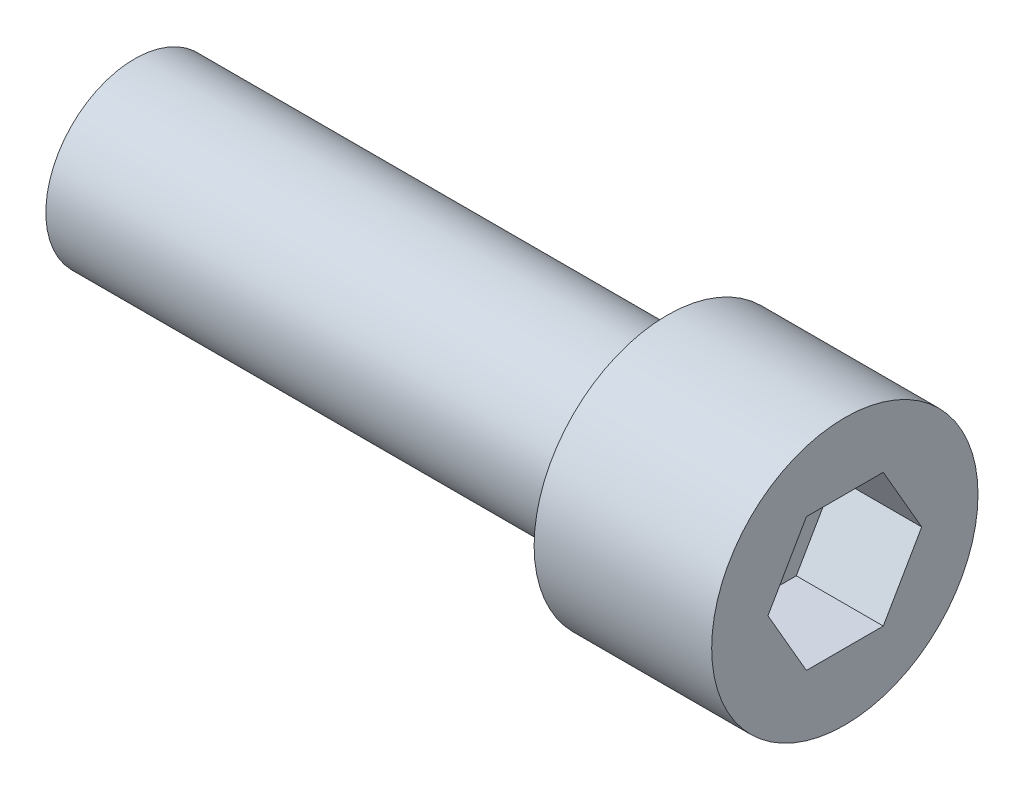
ISO-10303-21;
HEADER;
FILE_DESCRIPTION(('STEP AP214'),'2;1');
FILE_NAME('part.step','',(''),(''),'','','');
FILE_SCHEMA(('AUTOMOTIVE_DESIGN { 1 0 10303 214 1 1 1 1 }'));
ENDSEC;
DATA;
#1=APPLICATION_CONTEXT('core data for automotive mechanical design processes');
#2=APPLICATION_PROTOCOL_DEFINITION('international standard','automotive_design',2000,#1);
#3=PRODUCT_CONTEXT('',#1,'mechanical');
#4=PRODUCT('Part','Part','',(#3));
#5=PRODUCT_RELATED_PRODUCT_CATEGORY('part','',(#4));
#6=PRODUCT_DEFINITION_FORMATION('','',#4);
#7=PRODUCT_DEFINITION_CONTEXT('part definition',#1,'design');
#8=PRODUCT_DEFINITION('design','',#6,#7);
#9=PRODUCT_DEFINITION_SHAPE('','',#8);
#10=(LENGTH_UNIT() NAMED_UNIT(*) SI_UNIT(.MILLI.,.METRE.));
#11=(NAMED_UNIT(*) PLANE_ANGLE_UNIT() SI_UNIT($,.RADIAN.));
#12=(NAMED_UNIT(*) SI_UNIT($,.STERADIAN.) SOLID_ANGLE_UNIT());
#13=UNCERTAINTY_MEASURE_WITH_UNIT(LENGTH_MEASURE(1.E-05),#10,'distance_accuracy_value','');
#14=(GEOMETRIC_REPRESENTATION_CONTEXT(3) GLOBAL_UNCERTAINTY_ASSIGNED_CONTEXT((#13)) GLOBAL_UNIT_ASSIGNED_CONTEXT((#10,
#11,#12)) REPRESENTATION_CONTEXT('',''));
#15=CARTESIAN_POINT('',(0.,0.,0.));
#16=DIRECTION('',(0.,0.,1.));
#17=DIRECTION('',(1.,0.,0.));
#18=AXIS2_PLACEMENT_3D('',#15,#16,#17);
#19=CARTESIAN_POINT('',(-38.1,0.,0.));
#20=DIRECTION('',(1.,0.,0.));
#21=DIRECTION('',(0.,0.,-1.));
#22=AXIS2_PLACEMENT_3D('',#19,#20,#21);
#23=CYLINDRICAL_SURFACE('',#22,6.35);
#24=CARTESIAN_POINT('',(-38.1,0.,0.));
#25=DIRECTION('',(1.,0.,0.));
#26=DIRECTION('',(0.,0.,-1.));
#27=AXIS2_PLACEMENT_3D('',#24,#25,#26);
#28=CIRCLE('',#27,6.35);
#29=CARTESIAN_POINT('',(-38.1,0.,-6.35));
#30=VERTEX_POINT('',#29);
#31=EDGE_CURVE('E11',#30,#30,#28,.T.);
#32=ORIENTED_EDGE('',*,*,#31,.T.);
#33=EDGE_LOOP('',(#32));
#34=FACE_BOUND('',#33,.T.);
#35=CARTESIAN_POINT('',(0.,0.,0.));
#36=DIRECTION('',(1.,0.,0.));
#37=DIRECTION('',(0.,0.,-1.));
#38=AXIS2_PLACEMENT_3D('',#35,#36,#37);
#39=CIRCLE('',#38,6.35);
#40=CARTESIAN_POINT('',(0.,0.,-6.35));
#41=VERTEX_POINT('',#40);
#42=EDGE_CURVE('E41',#41,#41,#39,.T.);
#43=ORIENTED_EDGE('',*,*,#42,.F.);
#44=EDGE_LOOP('',(#43));
#45=FACE_BOUND('',#44,.T.);
#46=ADVANCED_FACE('F38',(#34,#45),#23,.T.);
#47=CARTESIAN_POINT('',(-38.1,0.,0.));
#48=DIRECTION('',(1.,0.,0.));
#49=DIRECTION('',(0.,0.,-1.));
#50=AXIS2_PLACEMENT_3D('',#47,#48,#49);
#51=PLANE('',#50);
#52=ORIENTED_EDGE('',*,*,#31,.F.);
#53=EDGE_LOOP('',(#52));
#54=FACE_BOUND('',#53,.T.);
#55=ADVANCED_FACE('F170',(#54),#51,.F.);
#56=CARTESIAN_POINT('',(12.7,0.,0.));
#57=DIRECTION('',(-1.,0.,0.));
#58=DIRECTION('',(0.,0.,1.));
#59=AXIS2_PLACEMENT_3D('',#56,#57,#58);
#60=CYLINDRICAL_SURFACE('',#59,9.525);
#61=CARTESIAN_POINT('',(12.7,0.,0.));
#62=DIRECTION('',(1.,0.,0.));
#63=DIRECTION('',(0.,0.,-1.));
#64=AXIS2_PLACEMENT_3D('',#61,#62,#63);
#65=CIRCLE('',#64,9.525);
#66=CARTESIAN_POINT('',(12.7,0.,-9.525));
#67=VERTEX_POINT('',#66);
#68=EDGE_CURVE('E145',#67,#67,#65,.T.);
#69=ORIENTED_EDGE('',*,*,#68,.F.);
#70=EDGE_LOOP('',(#69));
#71=FACE_BOUND('',#70,.T.);
#72=CARTESIAN_POINT('',(0.,0.,0.));
#73=DIRECTION('',(1.,0.,0.));
#74=DIRECTION('',(0.,0.,-1.));
#75=AXIS2_PLACEMENT_3D('',#72,#73,#74);
#76=CIRCLE('',#75,9.525);
#77=CARTESIAN_POINT('',(0.,0.,-9.525));
#78=VERTEX_POINT('',#77);
#79=EDGE_CURVE('E139',#78,#78,#76,.T.);
#80=ORIENTED_EDGE('',*,*,#79,.T.);
#81=EDGE_LOOP('',(#80));
#82=FACE_BOUND('',#81,.T.);
#83=ADVANCED_FACE('F151',(#71,#82),#60,.T.);
#84=CARTESIAN_POINT('',(12.7,0.,0.));
#85=DIRECTION('',(1.,0.,0.));
#86=DIRECTION('',(0.,0.,-1.));
#87=AXIS2_PLACEMENT_3D('',#84,#85,#86);
#88=PLANE('',#87);
#89=DIRECTION('',(0.,0.866025403784439,0.5));
#90=VECTOR('',#89,1.);
#91=CARTESIAN_POINT('',(12.7,0.,-5.49926131403119));
#92=LINE('',#91,#90);
#93=CARTESIAN_POINT('',(12.7,0.,-5.49926131403119));
#94=VERTEX_POINT('',#93);
#95=CARTESIAN_POINT('',(12.7,4.7625,-2.74963065701559));
#96=VERTEX_POINT('',#95);
#97=EDGE_CURVE('E52',#94,#96,#92,.T.);
#98=ORIENTED_EDGE('',*,*,#97,.F.);
#99=DIRECTION('',(0.,0.866025403784439,-0.5));
#100=VECTOR('',#99,1.);
#101=CARTESIAN_POINT('',(12.7,-4.7625,-2.74963065701559));
#102=LINE('',#101,#100);
#103=CARTESIAN_POINT('',(12.7,-4.7625,-2.74963065701559));
#104=VERTEX_POINT('',#103);
#105=EDGE_CURVE('E135',#104,#94,#102,.T.);
#106=ORIENTED_EDGE('',*,*,#105,.F.);
#107=DIRECTION('',(0.,0.,-1.));
#108=VECTOR('',#107,1.);
#109=CARTESIAN_POINT('',(12.7,-4.7625,2.74963065701559));
#110=LINE('',#109,#108);
#111=CARTESIAN_POINT('',(12.7,-4.7625,2.74963065701559));
#112=VERTEX_POINT('',#111);
#113=EDGE_CURVE('E133',#112,#104,#110,.T.);
#114=ORIENTED_EDGE('',*,*,#113,.F.);
#115=DIRECTION('',(0.,-0.866025403784439,-0.5));
#116=VECTOR('',#115,1.);
#117=CARTESIAN_POINT('',(12.7,0.,5.49926131403118));
#118=LINE('',#117,#116);
#119=CARTESIAN_POINT('',(12.7,0.,5.49926131403118));
#120=VERTEX_POINT('',#119);
#121=EDGE_CURVE('E100',#120,#112,#118,.T.);
#122=ORIENTED_EDGE('',*,*,#121,.F.);
#123=DIRECTION('',(0.,-0.866025403784439,0.5));
#124=VECTOR('',#123,1.);
#125=CARTESIAN_POINT('',(12.7,4.7625,2.74963065701559));
#126=LINE('',#125,#124);
#127=CARTESIAN_POINT('',(12.7,4.7625,2.74963065701559));
#128=VERTEX_POINT('',#127);
#129=EDGE_CURVE('E129',#128,#120,#126,.T.);
#130=ORIENTED_EDGE('',*,*,#129,.F.);
#131=DIRECTION('',(0.,0.,1.));
#132=VECTOR('',#131,1.);
#133=CARTESIAN_POINT('',(12.7,4.7625,-2.74963065701559));
#134=LINE('',#133,#132);
#135=EDGE_CURVE('E126',#96,#128,#134,.T.);
#136=ORIENTED_EDGE('',*,*,#135,.F.);
#137=EDGE_LOOP('',(#98,#106,#114,#122,#130,#136));
#138=FACE_BOUND('',#137,.T.);
#139=ORIENTED_EDGE('',*,*,#68,.T.);
#140=EDGE_LOOP('',(#139));
#141=FACE_BOUND('',#140,.T.);
#142=ADVANCED_FACE('F156',(#138,#141),#88,.T.);
#143=CARTESIAN_POINT('',(0.,0.,0.));
#144=DIRECTION('',(1.,0.,0.));
#145=DIRECTION('',(0.,0.,-1.));
#146=AXIS2_PLACEMENT_3D('',#143,#144,#145);
#147=PLANE('',#146);
#148=ORIENTED_EDGE('',*,*,#42,.T.);
#149=EDGE_LOOP('',(#148));
#150=FACE_BOUND('',#149,.T.);
#151=ORIENTED_EDGE('',*,*,#79,.F.);
#152=EDGE_LOOP('',(#151));
#153=FACE_BOUND('',#152,.T.);
#154=ADVANCED_FACE('F153',(#150,#153),#147,.F.);
#155=CARTESIAN_POINT('',(6.477,0.,-5.49926131403119));
#156=DIRECTION('',(0.,0.5,-0.866025403784438));
#157=DIRECTION('',(0.,0.866025403784439,0.5));
#158=AXIS2_PLACEMENT_3D('',#155,#156,#157);
#159=PLANE('',#158);
#160=ORIENTED_EDGE('',*,*,#97,.T.);
#161=DIRECTION('',(1.,0.,0.));
#162=VECTOR('',#161,1.);
#163=CARTESIAN_POINT('',(6.477,4.7625,-2.74963065701559));
#164=LINE('',#163,#162);
#165=CARTESIAN_POINT('',(6.477,4.7625,-2.74963065701559));
#166=VERTEX_POINT('',#165);
#167=EDGE_CURVE('E82',#166,#96,#164,.T.);
#168=ORIENTED_EDGE('',*,*,#167,.F.);
#169=DIRECTION('',(0.,0.866025403784439,0.5));
#170=VECTOR('',#169,1.);
#171=CARTESIAN_POINT('',(6.477,0.,-5.49926131403119));
#172=LINE('',#171,#170);
#173=CARTESIAN_POINT('',(6.477,0.,-5.49926131403119));
#174=VERTEX_POINT('',#173);
#175=EDGE_CURVE('E137',#174,#166,#172,.T.);
#176=ORIENTED_EDGE('',*,*,#175,.F.);
#177=DIRECTION('',(1.,0.,0.));
#178=VECTOR('',#177,1.);
#179=CARTESIAN_POINT('',(6.477,0.,-5.49926131403119));
#180=LINE('',#179,#178);
#181=EDGE_CURVE('E60',#174,#94,#180,.T.);
#182=ORIENTED_EDGE('',*,*,#181,.T.);
#183=EDGE_LOOP('',(#160,#168,#176,#182));
#184=FACE_BOUND('',#183,.T.);
#185=ADVANCED_FACE('F155',(#184),#159,.F.);
#186=CARTESIAN_POINT('',(6.477,-4.7625,-2.74963065701559));
#187=DIRECTION('',(0.,-0.5,-0.866025403784439));
#188=DIRECTION('',(0.,0.866025403784439,-0.5));
#189=AXIS2_PLACEMENT_3D('',#186,#187,#188);
#190=PLANE('',#189);
#191=ORIENTED_EDGE('',*,*,#105,.T.);
#192=ORIENTED_EDGE('',*,*,#181,.F.);
#193=DIRECTION('',(0.,0.866025403784439,-0.5));
#194=VECTOR('',#193,1.);
#195=CARTESIAN_POINT('',(6.477,-4.7625,-2.74963065701559));
#196=LINE('',#195,#194);
#197=CARTESIAN_POINT('',(6.477,-4.7625,-2.74963065701559));
#198=VERTEX_POINT('',#197);
#199=EDGE_CURVE('E112',#198,#174,#196,.T.);
#200=ORIENTED_EDGE('',*,*,#199,.F.);
#201=DIRECTION('',(1.,0.,0.));
#202=VECTOR('',#201,1.);
#203=CARTESIAN_POINT('',(6.477,-4.7625,-2.74963065701559));
#204=LINE('',#203,#202);
#205=EDGE_CURVE('E104',#198,#104,#204,.T.);
#206=ORIENTED_EDGE('',*,*,#205,.T.);
#207=EDGE_LOOP('',(#191,#192,#200,#206));
#208=FACE_BOUND('',#207,.T.);
#209=ADVANCED_FACE('F163',(#208),#190,.F.);
#210=CARTESIAN_POINT('',(6.477,-4.7625,2.74963065701559));
#211=DIRECTION('',(0.,-1.,0.));
#212=DIRECTION('',(0.,0.,-1.));
#213=AXIS2_PLACEMENT_3D('',#210,#211,#212);
#214=PLANE('',#213);
#215=ORIENTED_EDGE('',*,*,#113,.T.);
#216=ORIENTED_EDGE('',*,*,#205,.F.);
#217=DIRECTION('',(0.,0.,-1.));
#218=VECTOR('',#217,1.);
#219=CARTESIAN_POINT('',(6.477,-4.7625,2.74963065701559));
#220=LINE('',#219,#218);
#221=CARTESIAN_POINT('',(6.477,-4.7625,2.74963065701559));
#222=VERTEX_POINT('',#221);
#223=EDGE_CURVE('E108',#222,#198,#220,.T.);
#224=ORIENTED_EDGE('',*,*,#223,.F.);
#225=DIRECTION('',(1.,0.,0.));
#226=VECTOR('',#225,1.);
#227=CARTESIAN_POINT('',(6.477,-4.7625,2.74963065701559));
#228=LINE('',#227,#226);
#229=EDGE_CURVE('E93',#222,#112,#228,.T.);
#230=ORIENTED_EDGE('',*,*,#229,.T.);
#231=EDGE_LOOP('',(#215,#216,#224,#230));
#232=FACE_BOUND('',#231,.T.);
#233=ADVANCED_FACE('F109',(#232),#214,.F.);
#234=CARTESIAN_POINT('',(6.477,0.,5.49926131403118));
#235=DIRECTION('',(0.,-0.5,0.866025403784438));
#236=DIRECTION('',(0.,-0.866025403784439,-0.5));
#237=AXIS2_PLACEMENT_3D('',#234,#235,#236);
#238=PLANE('',#237);
#239=ORIENTED_EDGE('',*,*,#121,.T.);
#240=ORIENTED_EDGE('',*,*,#229,.F.);
#241=DIRECTION('',(0.,-0.866025403784439,-0.5));
#242=VECTOR('',#241,1.);
#243=CARTESIAN_POINT('',(6.477,0.,5.49926131403118));
#244=LINE('',#243,#242);
#245=CARTESIAN_POINT('',(6.477,0.,5.49926131403118));
#246=VERTEX_POINT('',#245);
#247=EDGE_CURVE('E97',#246,#222,#244,.T.);
#248=ORIENTED_EDGE('',*,*,#247,.F.);
#249=DIRECTION('',(1.,0.,0.));
#250=VECTOR('',#249,1.);
#251=CARTESIAN_POINT('',(6.477,0.,5.49926131403118));
#252=LINE('',#251,#250);
#253=EDGE_CURVE('E105',#246,#120,#252,.T.);
#254=ORIENTED_EDGE('',*,*,#253,.T.);
#255=EDGE_LOOP('',(#239,#240,#248,#254));
#256=FACE_BOUND('',#255,.T.);
#257=ADVANCED_FACE('F95',(#256),#238,.F.);
#258=CARTESIAN_POINT('',(6.477,4.7625,2.74963065701559));
#259=DIRECTION('',(0.,0.5,0.866025403784438));
#260=DIRECTION('',(0.,-0.866025403784439,0.5));
#261=AXIS2_PLACEMENT_3D('',#258,#259,#260);
#262=PLANE('',#261);
#263=ORIENTED_EDGE('',*,*,#129,.T.);
#264=ORIENTED_EDGE('',*,*,#253,.F.);
#265=DIRECTION('',(0.,-0.866025403784439,0.5));
#266=VECTOR('',#265,1.);
#267=CARTESIAN_POINT('',(6.477,4.7625,2.74963065701559));
#268=LINE('',#267,#266);
#269=CARTESIAN_POINT('',(6.477,4.7625,2.74963065701559));
#270=VERTEX_POINT('',#269);
#271=EDGE_CURVE('E118',#270,#246,#268,.T.);
#272=ORIENTED_EDGE('',*,*,#271,.F.);
#273=DIRECTION('',(1.,0.,0.));
#274=VECTOR('',#273,1.);
#275=CARTESIAN_POINT('',(6.477,4.7625,2.74963065701559));
#276=LINE('',#275,#274);
#277=EDGE_CURVE('E142',#270,#128,#276,.T.);
#278=ORIENTED_EDGE('',*,*,#277,.T.);
#279=EDGE_LOOP('',(#263,#264,#272,#278));
#280=FACE_BOUND('',#279,.T.);
#281=ADVANCED_FACE('F225',(#280),#262,.F.);
#282=CARTESIAN_POINT('',(6.477,4.7625,-2.74963065701559));
#283=DIRECTION('',(0.,1.,0.));
#284=DIRECTION('',(0.,0.,1.));
#285=AXIS2_PLACEMENT_3D('',#282,#283,#284);
#286=PLANE('',#285);
#287=ORIENTED_EDGE('',*,*,#135,.T.);
#288=ORIENTED_EDGE('',*,*,#277,.F.);
#289=DIRECTION('',(0.,0.,1.));
#290=VECTOR('',#289,1.);
#291=CARTESIAN_POINT('',(6.477,4.7625,-2.74963065701559));
#292=LINE('',#291,#290);
#293=EDGE_CURVE('E120',#166,#270,#292,.T.);
#294=ORIENTED_EDGE('',*,*,#293,.F.);
#295=ORIENTED_EDGE('',*,*,#167,.T.);
#296=EDGE_LOOP('',(#287,#288,#294,#295));
#297=FACE_BOUND('',#296,.T.);
#298=ADVANCED_FACE('F234',(#297),#286,.F.);
#299=CARTESIAN_POINT('',(6.477,0.,0.));
#300=DIRECTION('',(1.,0.,0.));
#301=DIRECTION('',(0.,0.,-1.));
#302=AXIS2_PLACEMENT_3D('',#299,#300,#301);
#303=PLANE('',#302);
#304=ORIENTED_EDGE('',*,*,#175,.T.);
#305=ORIENTED_EDGE('',*,*,#293,.T.);
#306=ORIENTED_EDGE('',*,*,#271,.T.);
#307=ORIENTED_EDGE('',*,*,#247,.T.);
#308=ORIENTED_EDGE('',*,*,#223,.T.);
#309=ORIENTED_EDGE('',*,*,#199,.T.);
#310=EDGE_LOOP('',(#304,#305,#306,#307,#308,#309));
#311=FACE_BOUND('',#310,.T.);
#312=ADVANCED_FACE('F115',(#311),#303,.T.);
#313=CLOSED_SHELL('',(#46,#55,#83,#142,#154,#185,#209,#233,#257,#281,#298,#312));
#314=MANIFOLD_SOLID_BREP('B2',#313);
#315=ADVANCED_BREP_SHAPE_REPRESENTATION('',(#18,#314),#14);
#316=SHAPE_DEFINITION_REPRESENTATION(#9,#315);
ENDSEC;
END-ISO-10303-21;
